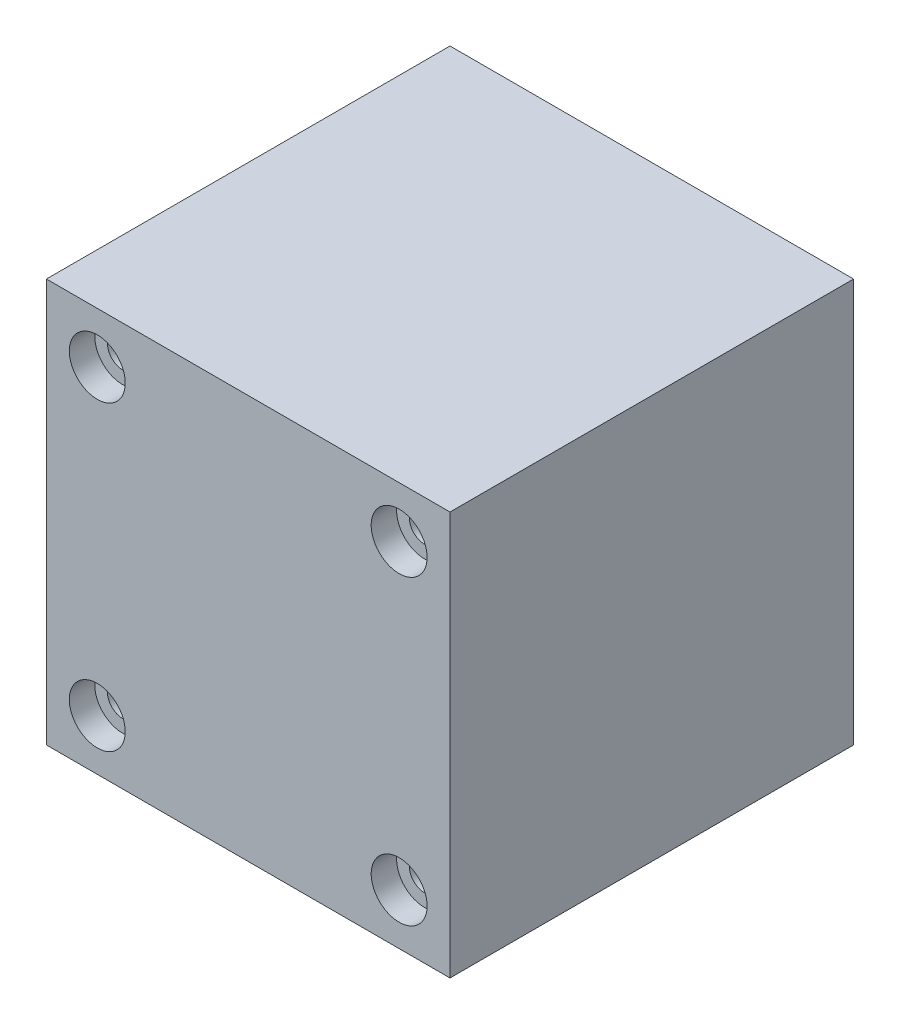
ISO-10303-21;
HEADER;
FILE_DESCRIPTION(('STEP AP214'),'2;1');
FILE_NAME('part.step','',(''),(''),'','','');
FILE_SCHEMA(('AUTOMOTIVE_DESIGN { 1 0 10303 214 1 1 1 1 }'));
ENDSEC;
DATA;
#1=APPLICATION_CONTEXT('core data for automotive mechanical design processes');
#2=APPLICATION_PROTOCOL_DEFINITION('international standard','automotive_design',2000,#1);
#3=PRODUCT_CONTEXT('',#1,'mechanical');
#4=PRODUCT('Part','Part','',(#3));
#5=PRODUCT_RELATED_PRODUCT_CATEGORY('part','',(#4));
#6=PRODUCT_DEFINITION_FORMATION('','',#4);
#7=PRODUCT_DEFINITION_CONTEXT('part definition',#1,'design');
#8=PRODUCT_DEFINITION('design','',#6,#7);
#9=PRODUCT_DEFINITION_SHAPE('','',#8);
#10=(LENGTH_UNIT() NAMED_UNIT(*) SI_UNIT(.MILLI.,.METRE.));
#11=(NAMED_UNIT(*) PLANE_ANGLE_UNIT() SI_UNIT($,.RADIAN.));
#12=(NAMED_UNIT(*) SI_UNIT($,.STERADIAN.) SOLID_ANGLE_UNIT());
#13=UNCERTAINTY_MEASURE_WITH_UNIT(LENGTH_MEASURE(1.E-05),#10,'distance_accuracy_value','');
#14=(GEOMETRIC_REPRESENTATION_CONTEXT(3) GLOBAL_UNCERTAINTY_ASSIGNED_CONTEXT((#13)) GLOBAL_UNIT_ASSIGNED_CONTEXT((#10,
#11,#12)) REPRESENTATION_CONTEXT('',''));
#15=CARTESIAN_POINT('',(0.,0.,0.));
#16=DIRECTION('',(0.,0.,1.));
#17=DIRECTION('',(1.,0.,0.));
#18=AXIS2_PLACEMENT_3D('',#15,#16,#17);
#19=CARTESIAN_POINT('',(0.,0.,31.75));
#20=DIRECTION('',(0.,0.,-1.));
#21=DIRECTION('',(-1.,0.,0.));
#22=AXIS2_PLACEMENT_3D('',#19,#20,#21);
#23=PLANE('',#22);
#24=CARTESIAN_POINT('',(-11.875,11.875,31.75));
#25=DIRECTION('',(0.,0.,1.));
#26=DIRECTION('',(1.,0.,0.));
#27=AXIS2_PLACEMENT_3D('',#24,#25,#26);
#28=CIRCLE('',#27,2.2);
#29=CARTESIAN_POINT('',(-9.675,11.875,31.75));
#30=VERTEX_POINT('',#29);
#31=EDGE_CURVE('E159',#30,#30,#28,.T.);
#32=ORIENTED_EDGE('',*,*,#31,.F.);
#33=EDGE_LOOP('',(#32));
#34=FACE_BOUND('',#33,.T.);
#35=CARTESIAN_POINT('',(11.875,-11.875,31.75));
#36=DIRECTION('',(0.,0.,1.));
#37=DIRECTION('',(1.,0.,0.));
#38=AXIS2_PLACEMENT_3D('',#35,#36,#37);
#39=CIRCLE('',#38,2.2);
#40=CARTESIAN_POINT('',(14.075,-11.875,31.75));
#41=VERTEX_POINT('',#40);
#42=EDGE_CURVE('E135',#41,#41,#39,.T.);
#43=ORIENTED_EDGE('',*,*,#42,.F.);
#44=EDGE_LOOP('',(#43));
#45=FACE_BOUND('',#44,.T.);
#46=CARTESIAN_POINT('',(-11.875,-11.875,31.75));
#47=DIRECTION('',(0.,0.,1.));
#48=DIRECTION('',(1.,0.,0.));
#49=AXIS2_PLACEMENT_3D('',#46,#47,#48);
#50=CIRCLE('',#49,2.2);
#51=CARTESIAN_POINT('',(-9.67499999999999,-11.875,31.75));
#52=VERTEX_POINT('',#51);
#53=EDGE_CURVE('E123',#52,#52,#50,.T.);
#54=ORIENTED_EDGE('',*,*,#53,.F.);
#55=EDGE_LOOP('',(#54));
#56=FACE_BOUND('',#55,.T.);
#57=DIRECTION('',(0.,1.,0.));
#58=VECTOR('',#57,1.);
#59=CARTESIAN_POINT('',(15.875,-15.875,31.75));
#60=LINE('',#59,#58);
#61=CARTESIAN_POINT('',(15.875,-15.875,31.75));
#62=VERTEX_POINT('',#61);
#63=CARTESIAN_POINT('',(15.875,15.875,31.75));
#64=VERTEX_POINT('',#63);
#65=EDGE_CURVE('E89',#62,#64,#60,.T.);
#66=ORIENTED_EDGE('',*,*,#65,.T.);
#67=DIRECTION('',(-1.,0.,0.));
#68=VECTOR('',#67,1.);
#69=CARTESIAN_POINT('',(-15.875,15.875,31.75));
#70=LINE('',#69,#68);
#71=CARTESIAN_POINT('',(-15.875,15.875,31.75));
#72=VERTEX_POINT('',#71);
#73=EDGE_CURVE('E84',#64,#72,#70,.T.);
#74=ORIENTED_EDGE('',*,*,#73,.T.);
#75=DIRECTION('',(0.,-1.,0.));
#76=VECTOR('',#75,1.);
#77=CARTESIAN_POINT('',(-15.875,-15.875,31.75));
#78=LINE('',#77,#76);
#79=CARTESIAN_POINT('',(-15.875,-15.875,31.75));
#80=VERTEX_POINT('',#79);
#81=EDGE_CURVE('E87',#72,#80,#78,.T.);
#82=ORIENTED_EDGE('',*,*,#81,.T.);
#83=DIRECTION('',(1.,0.,0.));
#84=VECTOR('',#83,1.);
#85=CARTESIAN_POINT('',(-15.875,-15.875,31.75));
#86=LINE('',#85,#84);
#87=EDGE_CURVE('E54',#80,#62,#86,.T.);
#88=ORIENTED_EDGE('',*,*,#87,.T.);
#89=EDGE_LOOP('',(#66,#74,#82,#88));
#90=FACE_BOUND('',#89,.T.);
#91=CARTESIAN_POINT('',(11.875,11.875,31.75));
#92=DIRECTION('',(0.,0.,1.));
#93=DIRECTION('',(1.,0.,0.));
#94=AXIS2_PLACEMENT_3D('',#91,#92,#93);
#95=CIRCLE('',#94,2.2);
#96=CARTESIAN_POINT('',(14.075,11.875,31.75));
#97=VERTEX_POINT('',#96);
#98=EDGE_CURVE('E147',#97,#97,#95,.T.);
#99=ORIENTED_EDGE('',*,*,#98,.F.);
#100=EDGE_LOOP('',(#99));
#101=FACE_BOUND('',#100,.T.);
#102=ADVANCED_FACE('F37',(#34,#45,#56,#90,#101),#23,.F.);
#103=CARTESIAN_POINT('',(15.875,-15.875,31.75));
#104=DIRECTION('',(-1.,0.,0.));
#105=DIRECTION('',(0.,0.,1.));
#106=AXIS2_PLACEMENT_3D('',#103,#104,#105);
#107=PLANE('',#106);
#108=DIRECTION('',(0.,1.,0.));
#109=VECTOR('',#108,1.);
#110=CARTESIAN_POINT('',(15.875,-15.875,0.));
#111=LINE('',#110,#109);
#112=CARTESIAN_POINT('',(15.875,-15.875,0.));
#113=VERTEX_POINT('',#112);
#114=CARTESIAN_POINT('',(15.875,15.875,0.));
#115=VERTEX_POINT('',#114);
#116=EDGE_CURVE('E101',#113,#115,#111,.T.);
#117=ORIENTED_EDGE('',*,*,#116,.T.);
#118=DIRECTION('',(0.,0.,-1.));
#119=VECTOR('',#118,1.);
#120=CARTESIAN_POINT('',(15.875,15.875,31.75));
#121=LINE('',#120,#119);
#122=EDGE_CURVE('E11',#64,#115,#121,.T.);
#123=ORIENTED_EDGE('',*,*,#122,.F.);
#124=ORIENTED_EDGE('',*,*,#65,.F.);
#125=DIRECTION('',(0.,0.,-1.));
#126=VECTOR('',#125,1.);
#127=CARTESIAN_POINT('',(15.875,-15.875,31.75));
#128=LINE('',#127,#126);
#129=EDGE_CURVE('E97',#62,#113,#128,.T.);
#130=ORIENTED_EDGE('',*,*,#129,.T.);
#131=EDGE_LOOP('',(#117,#123,#124,#130));
#132=FACE_BOUND('',#131,.T.);
#133=ADVANCED_FACE('F39',(#132),#107,.F.);
#134=CARTESIAN_POINT('',(-15.875,15.875,31.75));
#135=DIRECTION('',(0.,-1.,0.));
#136=DIRECTION('',(0.,0.,-1.));
#137=AXIS2_PLACEMENT_3D('',#134,#135,#136);
#138=PLANE('',#137);
#139=DIRECTION('',(-1.,0.,0.));
#140=VECTOR('',#139,1.);
#141=CARTESIAN_POINT('',(-15.875,15.875,0.));
#142=LINE('',#141,#140);
#143=CARTESIAN_POINT('',(-15.875,15.875,0.));
#144=VERTEX_POINT('',#143);
#145=EDGE_CURVE('E93',#115,#144,#142,.T.);
#146=ORIENTED_EDGE('',*,*,#145,.T.);
#147=DIRECTION('',(0.,0.,-1.));
#148=VECTOR('',#147,1.);
#149=CARTESIAN_POINT('',(-15.875,15.875,31.75));
#150=LINE('',#149,#148);
#151=EDGE_CURVE('E46',#72,#144,#150,.T.);
#152=ORIENTED_EDGE('',*,*,#151,.F.);
#153=ORIENTED_EDGE('',*,*,#73,.F.);
#154=ORIENTED_EDGE('',*,*,#122,.T.);
#155=EDGE_LOOP('',(#146,#152,#153,#154));
#156=FACE_BOUND('',#155,.T.);
#157=ADVANCED_FACE('F92',(#156),#138,.F.);
#158=CARTESIAN_POINT('',(-15.875,-15.875,31.75));
#159=DIRECTION('',(1.,0.,0.));
#160=DIRECTION('',(0.,0.,-1.));
#161=AXIS2_PLACEMENT_3D('',#158,#159,#160);
#162=PLANE('',#161);
#163=DIRECTION('',(0.,-1.,0.));
#164=VECTOR('',#163,1.);
#165=CARTESIAN_POINT('',(-15.875,-15.875,0.));
#166=LINE('',#165,#164);
#167=CARTESIAN_POINT('',(-15.875,-15.875,0.));
#168=VERTEX_POINT('',#167);
#169=EDGE_CURVE('E71',#144,#168,#166,.T.);
#170=ORIENTED_EDGE('',*,*,#169,.T.);
#171=DIRECTION('',(0.,0.,-1.));
#172=VECTOR('',#171,1.);
#173=CARTESIAN_POINT('',(-15.875,-15.875,31.75));
#174=LINE('',#173,#172);
#175=EDGE_CURVE('E94',#80,#168,#174,.T.);
#176=ORIENTED_EDGE('',*,*,#175,.F.);
#177=ORIENTED_EDGE('',*,*,#81,.F.);
#178=ORIENTED_EDGE('',*,*,#151,.T.);
#179=EDGE_LOOP('',(#170,#176,#177,#178));
#180=FACE_BOUND('',#179,.T.);
#181=ADVANCED_FACE('F95',(#180),#162,.F.);
#182=CARTESIAN_POINT('',(-15.875,-15.875,31.75));
#183=DIRECTION('',(0.,1.,0.));
#184=DIRECTION('',(0.,0.,1.));
#185=AXIS2_PLACEMENT_3D('',#182,#183,#184);
#186=PLANE('',#185);
#187=DIRECTION('',(1.,0.,0.));
#188=VECTOR('',#187,1.);
#189=CARTESIAN_POINT('',(-15.875,-15.875,0.));
#190=LINE('',#189,#188);
#191=EDGE_CURVE('E77',#168,#113,#190,.T.);
#192=ORIENTED_EDGE('',*,*,#191,.T.);
#193=ORIENTED_EDGE('',*,*,#129,.F.);
#194=ORIENTED_EDGE('',*,*,#87,.F.);
#195=ORIENTED_EDGE('',*,*,#175,.T.);
#196=EDGE_LOOP('',(#192,#193,#194,#195));
#197=FACE_BOUND('',#196,.T.);
#198=ADVANCED_FACE('F109',(#197),#186,.F.);
#199=CARTESIAN_POINT('',(0.,0.,0.));
#200=DIRECTION('',(0.,0.,-1.));
#201=DIRECTION('',(-1.,0.,0.));
#202=AXIS2_PLACEMENT_3D('',#199,#200,#201);
#203=PLANE('',#202);
#204=CARTESIAN_POINT('',(-11.875,11.875,0.));
#205=DIRECTION('',(0.,0.,1.));
#206=DIRECTION('',(1.,0.,0.));
#207=AXIS2_PLACEMENT_3D('',#204,#205,#206);
#208=CIRCLE('',#207,1.19999999999999);
#209=CARTESIAN_POINT('',(-10.675,11.875,0.));
#210=VERTEX_POINT('',#209);
#211=EDGE_CURVE('E150',#210,#210,#208,.T.);
#212=ORIENTED_EDGE('',*,*,#211,.T.);
#213=EDGE_LOOP('',(#212));
#214=FACE_BOUND('',#213,.T.);
#215=CARTESIAN_POINT('',(11.875,11.875,0.));
#216=DIRECTION('',(0.,0.,1.));
#217=DIRECTION('',(1.,0.,0.));
#218=AXIS2_PLACEMENT_3D('',#215,#216,#217);
#219=CIRCLE('',#218,1.19999999999999);
#220=CARTESIAN_POINT('',(13.075,11.875,0.));
#221=VERTEX_POINT('',#220);
#222=EDGE_CURVE('E138',#221,#221,#219,.T.);
#223=ORIENTED_EDGE('',*,*,#222,.T.);
#224=EDGE_LOOP('',(#223));
#225=FACE_BOUND('',#224,.T.);
#226=CARTESIAN_POINT('',(11.875,-11.875,0.));
#227=DIRECTION('',(0.,0.,1.));
#228=DIRECTION('',(1.,0.,0.));
#229=AXIS2_PLACEMENT_3D('',#226,#227,#228);
#230=CIRCLE('',#229,1.19999999999999);
#231=CARTESIAN_POINT('',(13.075,-11.875,0.));
#232=VERTEX_POINT('',#231);
#233=EDGE_CURVE('E126',#232,#232,#230,.T.);
#234=ORIENTED_EDGE('',*,*,#233,.T.);
#235=EDGE_LOOP('',(#234));
#236=FACE_BOUND('',#235,.T.);
#237=CARTESIAN_POINT('',(-11.875,-11.875,0.));
#238=DIRECTION('',(0.,0.,1.));
#239=DIRECTION('',(1.,0.,0.));
#240=AXIS2_PLACEMENT_3D('',#237,#238,#239);
#241=CIRCLE('',#240,1.19999999999999);
#242=CARTESIAN_POINT('',(-10.675,-11.875,0.));
#243=VERTEX_POINT('',#242);
#244=EDGE_CURVE('E104',#243,#243,#241,.T.);
#245=ORIENTED_EDGE('',*,*,#244,.T.);
#246=EDGE_LOOP('',(#245));
#247=FACE_BOUND('',#246,.T.);
#248=ORIENTED_EDGE('',*,*,#116,.F.);
#249=ORIENTED_EDGE('',*,*,#191,.F.);
#250=ORIENTED_EDGE('',*,*,#169,.F.);
#251=ORIENTED_EDGE('',*,*,#145,.F.);
#252=EDGE_LOOP('',(#248,#249,#250,#251));
#253=FACE_BOUND('',#252,.T.);
#254=ADVANCED_FACE('F112',(#214,#225,#236,#247,#253),#203,.T.);
#255=CARTESIAN_POINT('',(-11.875,-11.875,31.75));
#256=DIRECTION('',(0.,0.,1.));
#257=DIRECTION('',(1.,0.,0.));
#258=AXIS2_PLACEMENT_3D('',#255,#256,#257);
#259=CYLINDRICAL_SURFACE('',#258,1.2);
#260=ORIENTED_EDGE('',*,*,#244,.F.);
#261=EDGE_LOOP('',(#260));
#262=FACE_BOUND('',#261,.T.);
#263=CARTESIAN_POINT('',(-11.875,-11.875,29.75));
#264=DIRECTION('',(0.,0.,1.));
#265=DIRECTION('',(1.,0.,0.));
#266=AXIS2_PLACEMENT_3D('',#263,#264,#265);
#267=CIRCLE('',#266,1.2);
#268=CARTESIAN_POINT('',(-10.675,-11.875,29.75));
#269=VERTEX_POINT('',#268);
#270=EDGE_CURVE('E117',#269,#269,#267,.T.);
#271=ORIENTED_EDGE('',*,*,#270,.T.);
#272=EDGE_LOOP('',(#271));
#273=FACE_BOUND('',#272,.T.);
#274=ADVANCED_FACE('F185',(#262,#273),#259,.F.);
#275=CARTESIAN_POINT('',(-10.675,-11.875,29.75));
#276=DIRECTION('',(0.,0.,-1.));
#277=DIRECTION('',(-1.,0.,0.));
#278=AXIS2_PLACEMENT_3D('',#275,#276,#277);
#279=PLANE('',#278);
#280=ORIENTED_EDGE('',*,*,#270,.F.);
#281=EDGE_LOOP('',(#280));
#282=FACE_BOUND('',#281,.T.);
#283=CARTESIAN_POINT('',(-11.875,-11.875,29.75));
#284=DIRECTION('',(0.,0.,1.));
#285=DIRECTION('',(1.,0.,0.));
#286=AXIS2_PLACEMENT_3D('',#283,#284,#285);
#287=CIRCLE('',#286,2.2);
#288=CARTESIAN_POINT('',(-9.67499999999999,-11.875,29.75));
#289=VERTEX_POINT('',#288);
#290=EDGE_CURVE('E120',#289,#289,#287,.T.);
#291=ORIENTED_EDGE('',*,*,#290,.T.);
#292=EDGE_LOOP('',(#291));
#293=FACE_BOUND('',#292,.T.);
#294=ADVANCED_FACE('F175',(#282,#293),#279,.F.);
#295=CARTESIAN_POINT('',(-11.875,-11.875,31.75));
#296=DIRECTION('',(0.,0.,1.));
#297=DIRECTION('',(1.,0.,0.));
#298=AXIS2_PLACEMENT_3D('',#295,#296,#297);
#299=CYLINDRICAL_SURFACE('',#298,2.2);
#300=ORIENTED_EDGE('',*,*,#290,.F.);
#301=EDGE_LOOP('',(#300));
#302=FACE_BOUND('',#301,.T.);
#303=ORIENTED_EDGE('',*,*,#53,.T.);
#304=EDGE_LOOP('',(#303));
#305=FACE_BOUND('',#304,.T.);
#306=ADVANCED_FACE('F172',(#302,#305),#299,.F.);
#307=CARTESIAN_POINT('',(11.875,-11.875,31.75));
#308=DIRECTION('',(0.,0.,1.));
#309=DIRECTION('',(1.,0.,0.));
#310=AXIS2_PLACEMENT_3D('',#307,#308,#309);
#311=CYLINDRICAL_SURFACE('',#310,1.2);
#312=ORIENTED_EDGE('',*,*,#233,.F.);
#313=EDGE_LOOP('',(#312));
#314=FACE_BOUND('',#313,.T.);
#315=CARTESIAN_POINT('',(11.875,-11.875,29.75));
#316=DIRECTION('',(0.,0.,1.));
#317=DIRECTION('',(1.,0.,0.));
#318=AXIS2_PLACEMENT_3D('',#315,#316,#317);
#319=CIRCLE('',#318,1.2);
#320=CARTESIAN_POINT('',(13.075,-11.875,29.75));
#321=VERTEX_POINT('',#320);
#322=EDGE_CURVE('E129',#321,#321,#319,.T.);
#323=ORIENTED_EDGE('',*,*,#322,.T.);
#324=EDGE_LOOP('',(#323));
#325=FACE_BOUND('',#324,.T.);
#326=ADVANCED_FACE('F174',(#314,#325),#311,.F.);
#327=CARTESIAN_POINT('',(13.075,-11.875,29.75));
#328=DIRECTION('',(0.,0.,-1.));
#329=DIRECTION('',(-1.,0.,0.));
#330=AXIS2_PLACEMENT_3D('',#327,#328,#329);
#331=PLANE('',#330);
#332=ORIENTED_EDGE('',*,*,#322,.F.);
#333=EDGE_LOOP('',(#332));
#334=FACE_BOUND('',#333,.T.);
#335=CARTESIAN_POINT('',(11.875,-11.875,29.75));
#336=DIRECTION('',(0.,0.,1.));
#337=DIRECTION('',(1.,0.,0.));
#338=AXIS2_PLACEMENT_3D('',#335,#336,#337);
#339=CIRCLE('',#338,2.2);
#340=CARTESIAN_POINT('',(14.075,-11.875,29.75));
#341=VERTEX_POINT('',#340);
#342=EDGE_CURVE('E132',#341,#341,#339,.T.);
#343=ORIENTED_EDGE('',*,*,#342,.T.);
#344=EDGE_LOOP('',(#343));
#345=FACE_BOUND('',#344,.T.);
#346=ADVANCED_FACE('F182',(#334,#345),#331,.F.);
#347=CARTESIAN_POINT('',(11.875,-11.875,31.75));
#348=DIRECTION('',(0.,0.,1.));
#349=DIRECTION('',(1.,0.,0.));
#350=AXIS2_PLACEMENT_3D('',#347,#348,#349);
#351=CYLINDRICAL_SURFACE('',#350,2.2);
#352=ORIENTED_EDGE('',*,*,#342,.F.);
#353=EDGE_LOOP('',(#352));
#354=FACE_BOUND('',#353,.T.);
#355=ORIENTED_EDGE('',*,*,#42,.T.);
#356=EDGE_LOOP('',(#355));
#357=FACE_BOUND('',#356,.T.);
#358=ADVANCED_FACE('F251',(#354,#357),#351,.F.);
#359=CARTESIAN_POINT('',(11.875,11.875,31.75));
#360=DIRECTION('',(0.,0.,1.));
#361=DIRECTION('',(1.,0.,0.));
#362=AXIS2_PLACEMENT_3D('',#359,#360,#361);
#363=CYLINDRICAL_SURFACE('',#362,1.2);
#364=ORIENTED_EDGE('',*,*,#222,.F.);
#365=EDGE_LOOP('',(#364));
#366=FACE_BOUND('',#365,.T.);
#367=CARTESIAN_POINT('',(11.875,11.875,29.75));
#368=DIRECTION('',(0.,0.,1.));
#369=DIRECTION('',(1.,0.,0.));
#370=AXIS2_PLACEMENT_3D('',#367,#368,#369);
#371=CIRCLE('',#370,1.2);
#372=CARTESIAN_POINT('',(13.075,11.875,29.75));
#373=VERTEX_POINT('',#372);
#374=EDGE_CURVE('E141',#373,#373,#371,.T.);
#375=ORIENTED_EDGE('',*,*,#374,.T.);
#376=EDGE_LOOP('',(#375));
#377=FACE_BOUND('',#376,.T.);
#378=ADVANCED_FACE('F260',(#366,#377),#363,.F.);
#379=CARTESIAN_POINT('',(13.075,11.875,29.75));
#380=DIRECTION('',(0.,0.,-1.));
#381=DIRECTION('',(-1.,0.,0.));
#382=AXIS2_PLACEMENT_3D('',#379,#380,#381);
#383=PLANE('',#382);
#384=ORIENTED_EDGE('',*,*,#374,.F.);
#385=EDGE_LOOP('',(#384));
#386=FACE_BOUND('',#385,.T.);
#387=CARTESIAN_POINT('',(11.875,11.875,29.75));
#388=DIRECTION('',(0.,0.,1.));
#389=DIRECTION('',(1.,0.,0.));
#390=AXIS2_PLACEMENT_3D('',#387,#388,#389);
#391=CIRCLE('',#390,2.2);
#392=CARTESIAN_POINT('',(14.075,11.875,29.75));
#393=VERTEX_POINT('',#392);
#394=EDGE_CURVE('E144',#393,#393,#391,.T.);
#395=ORIENTED_EDGE('',*,*,#394,.T.);
#396=EDGE_LOOP('',(#395));
#397=FACE_BOUND('',#396,.T.);
#398=ADVANCED_FACE('F270',(#386,#397),#383,.F.);
#399=CARTESIAN_POINT('',(11.875,11.875,31.75));
#400=DIRECTION('',(0.,0.,1.));
#401=DIRECTION('',(1.,0.,0.));
#402=AXIS2_PLACEMENT_3D('',#399,#400,#401);
#403=CYLINDRICAL_SURFACE('',#402,2.2);
#404=ORIENTED_EDGE('',*,*,#394,.F.);
#405=EDGE_LOOP('',(#404));
#406=FACE_BOUND('',#405,.T.);
#407=ORIENTED_EDGE('',*,*,#98,.T.);
#408=EDGE_LOOP('',(#407));
#409=FACE_BOUND('',#408,.T.);
#410=ADVANCED_FACE('F280',(#406,#409),#403,.F.);
#411=CARTESIAN_POINT('',(-11.875,11.875,31.75));
#412=DIRECTION('',(0.,0.,1.));
#413=DIRECTION('',(1.,0.,0.));
#414=AXIS2_PLACEMENT_3D('',#411,#412,#413);
#415=CYLINDRICAL_SURFACE('',#414,1.2);
#416=ORIENTED_EDGE('',*,*,#211,.F.);
#417=EDGE_LOOP('',(#416));
#418=FACE_BOUND('',#417,.T.);
#419=CARTESIAN_POINT('',(-11.875,11.875,29.75));
#420=DIRECTION('',(0.,0.,1.));
#421=DIRECTION('',(1.,0.,0.));
#422=AXIS2_PLACEMENT_3D('',#419,#420,#421);
#423=CIRCLE('',#422,1.2);
#424=CARTESIAN_POINT('',(-10.675,11.875,29.75));
#425=VERTEX_POINT('',#424);
#426=EDGE_CURVE('E153',#425,#425,#423,.T.);
#427=ORIENTED_EDGE('',*,*,#426,.T.);
#428=EDGE_LOOP('',(#427));
#429=FACE_BOUND('',#428,.T.);
#430=ADVANCED_FACE('F290',(#418,#429),#415,.F.);
#431=CARTESIAN_POINT('',(-10.675,11.875,29.75));
#432=DIRECTION('',(0.,0.,-1.));
#433=DIRECTION('',(-1.,0.,0.));
#434=AXIS2_PLACEMENT_3D('',#431,#432,#433);
#435=PLANE('',#434);
#436=ORIENTED_EDGE('',*,*,#426,.F.);
#437=EDGE_LOOP('',(#436));
#438=FACE_BOUND('',#437,.T.);
#439=CARTESIAN_POINT('',(-11.875,11.875,29.75));
#440=DIRECTION('',(0.,0.,1.));
#441=DIRECTION('',(1.,0.,0.));
#442=AXIS2_PLACEMENT_3D('',#439,#440,#441);
#443=CIRCLE('',#442,2.2);
#444=CARTESIAN_POINT('',(-9.675,11.875,29.75));
#445=VERTEX_POINT('',#444);
#446=EDGE_CURVE('E156',#445,#445,#443,.T.);
#447=ORIENTED_EDGE('',*,*,#446,.T.);
#448=EDGE_LOOP('',(#447));
#449=FACE_BOUND('',#448,.T.);
#450=ADVANCED_FACE('F300',(#438,#449),#435,.F.);
#451=CARTESIAN_POINT('',(-11.875,11.875,31.75));
#452=DIRECTION('',(0.,0.,1.));
#453=DIRECTION('',(1.,0.,0.));
#454=AXIS2_PLACEMENT_3D('',#451,#452,#453);
#455=CYLINDRICAL_SURFACE('',#454,2.2);
#456=ORIENTED_EDGE('',*,*,#446,.F.);
#457=EDGE_LOOP('',(#456));
#458=FACE_BOUND('',#457,.T.);
#459=ORIENTED_EDGE('',*,*,#31,.T.);
#460=EDGE_LOOP('',(#459));
#461=FACE_BOUND('',#460,.T.);
#462=ADVANCED_FACE('F163',(#458,#461),#455,.F.);
#463=CLOSED_SHELL('',(#102,#133,#157,#181,#198,#254,#274,#294,#306,#326,#346,#358,#378,#398,
#410,#430,#450,#462));
#464=MANIFOLD_SOLID_BREP('B2',#463);
#465=ADVANCED_BREP_SHAPE_REPRESENTATION('',(#18,#464),#14);
#466=SHAPE_DEFINITION_REPRESENTATION(#9,#465);
ENDSEC;
END-ISO-10303-21;
